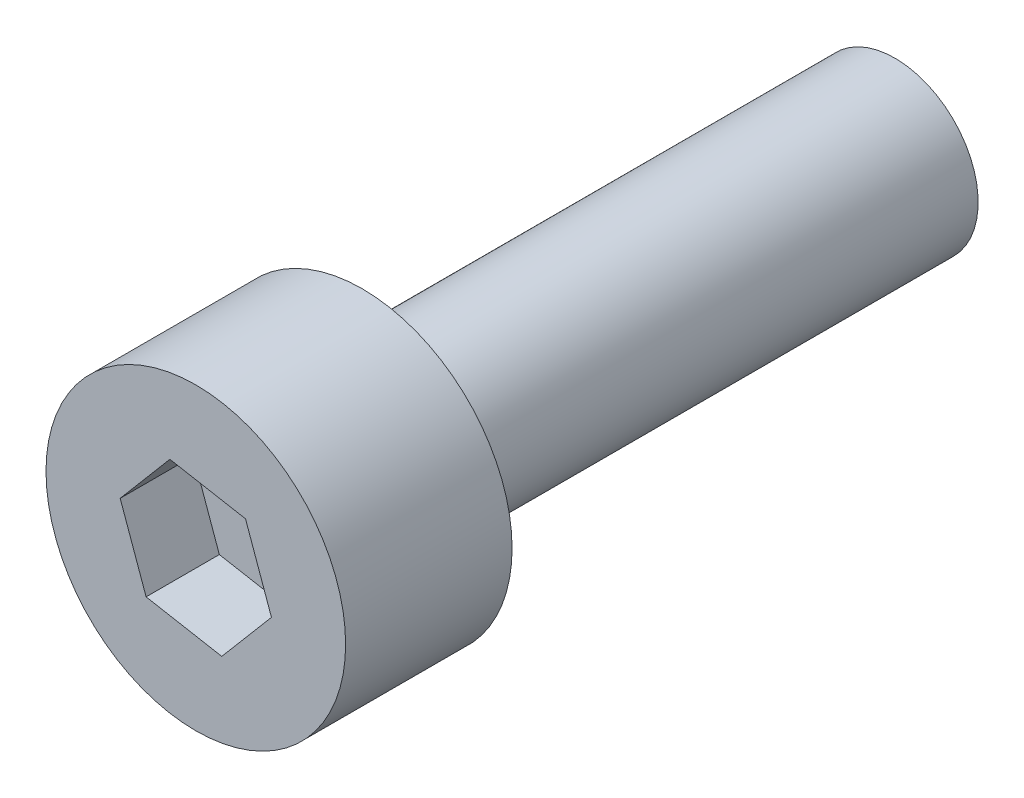
ISO-10303-21;
HEADER;
FILE_DESCRIPTION(('STEP AP214'),'2;1');
FILE_NAME('part.step','',(''),(''),'','','');
FILE_SCHEMA(('AUTOMOTIVE_DESIGN { 1 0 10303 214 1 1 1 1 }'));
ENDSEC;
DATA;
#1=APPLICATION_CONTEXT('core data for automotive mechanical design processes');
#2=APPLICATION_PROTOCOL_DEFINITION('international standard','automotive_design',2000,#1);
#3=PRODUCT_CONTEXT('',#1,'mechanical');
#4=PRODUCT('Part','Part','',(#3));
#5=PRODUCT_RELATED_PRODUCT_CATEGORY('part','',(#4));
#6=PRODUCT_DEFINITION_FORMATION('','',#4);
#7=PRODUCT_DEFINITION_CONTEXT('part definition',#1,'design');
#8=PRODUCT_DEFINITION('design','',#6,#7);
#9=PRODUCT_DEFINITION_SHAPE('','',#8);
#10=(LENGTH_UNIT() NAMED_UNIT(*) SI_UNIT(.MILLI.,.METRE.));
#11=(NAMED_UNIT(*) PLANE_ANGLE_UNIT() SI_UNIT($,.RADIAN.));
#12=(NAMED_UNIT(*) SI_UNIT($,.STERADIAN.) SOLID_ANGLE_UNIT());
#13=UNCERTAINTY_MEASURE_WITH_UNIT(LENGTH_MEASURE(1.E-05),#10,'distance_accuracy_value','');
#14=(GEOMETRIC_REPRESENTATION_CONTEXT(3) GLOBAL_UNCERTAINTY_ASSIGNED_CONTEXT((#13)) GLOBAL_UNIT_ASSIGNED_CONTEXT((#10,
#11,#12)) REPRESENTATION_CONTEXT('',''));
#15=CARTESIAN_POINT('',(0.,0.,0.));
#16=DIRECTION('',(0.,0.,1.));
#17=DIRECTION('',(1.,0.,0.));
#18=AXIS2_PLACEMENT_3D('',#15,#16,#17);
#19=CARTESIAN_POINT('',(0.,0.,2.5));
#20=DIRECTION('',(0.,0.,-1.));
#21=DIRECTION('',(-1.,0.,0.));
#22=AXIS2_PLACEMENT_3D('',#19,#20,#21);
#23=CYLINDRICAL_SURFACE('',#22,2.25);
#24=CARTESIAN_POINT('',(0.,0.,2.5));
#25=DIRECTION('',(0.,0.,1.));
#26=DIRECTION('',(1.,0.,0.));
#27=AXIS2_PLACEMENT_3D('',#24,#25,#26);
#28=CIRCLE('',#27,2.25);
#29=CARTESIAN_POINT('',(2.25,0.,2.5));
#30=VERTEX_POINT('',#29);
#31=EDGE_CURVE('E45',#30,#30,#28,.T.);
#32=ORIENTED_EDGE('',*,*,#31,.F.);
#33=EDGE_LOOP('',(#32));
#34=FACE_BOUND('',#33,.T.);
#35=CARTESIAN_POINT('',(0.,0.,0.));
#36=DIRECTION('',(0.,0.,1.));
#37=DIRECTION('',(1.,0.,0.));
#38=AXIS2_PLACEMENT_3D('',#35,#36,#37);
#39=CIRCLE('',#38,2.25);
#40=CARTESIAN_POINT('',(2.25,0.,0.));
#41=VERTEX_POINT('',#40);
#42=EDGE_CURVE('E40',#41,#41,#39,.T.);
#43=ORIENTED_EDGE('',*,*,#42,.T.);
#44=EDGE_LOOP('',(#43));
#45=FACE_BOUND('',#44,.T.);
#46=ADVANCED_FACE('F37',(#34,#45),#23,.T.);
#47=CARTESIAN_POINT('',(0.,0.,2.5));
#48=DIRECTION('',(0.,0.,1.));
#49=DIRECTION('',(1.,0.,0.));
#50=AXIS2_PLACEMENT_3D('',#47,#48,#49);
#51=PLANE('',#50);
#52=DIRECTION('',(0.983936268345051,-0.178520082442331,0.));
#53=VECTOR('',#52,1.);
#54=CARTESIAN_POINT('',(-0.178520082442331,-0.983936268345051,2.5));
#55=LINE('',#54,#53);
#56=CARTESIAN_POINT('',(-0.746595951836782,-0.880867650691217,2.5));
#57=VERTEX_POINT('',#56);
#58=CARTESIAN_POINT('',(0.389555786952119,-1.08700488599889,2.5));
#59=VERTEX_POINT('',#58);
#60=EDGE_CURVE('E53',#57,#59,#55,.T.);
#61=ORIENTED_EDGE('',*,*,#60,.F.);
#62=DIRECTION('',(0.337365207691775,-0.941373845312842,0.));
#63=VECTOR('',#62,1.);
#64=CARTESIAN_POINT('',(-0.941373845312842,-0.337365207691775,2.5));
#65=LINE('',#64,#63);
#66=CARTESIAN_POINT('',(-1.1361517387889,0.206137235307668,2.5));
#67=VERTEX_POINT('',#66);
#68=EDGE_CURVE('E137',#67,#57,#65,.T.);
#69=ORIENTED_EDGE('',*,*,#68,.F.);
#70=DIRECTION('',(-0.646571060653276,-0.762853762870511,0.));
#71=VECTOR('',#70,1.);
#72=CARTESIAN_POINT('',(-0.762853762870511,0.646571060653276,2.5));
#73=LINE('',#72,#71);
#74=CARTESIAN_POINT('',(-0.38955578695212,1.08700488599888,2.5));
#75=VERTEX_POINT('',#74);
#76=EDGE_CURVE('E135',#75,#67,#73,.T.);
#77=ORIENTED_EDGE('',*,*,#76,.F.);
#78=DIRECTION('',(-0.983936268345051,0.178520082442331,0.));
#79=VECTOR('',#78,1.);
#80=CARTESIAN_POINT('',(0.178520082442331,0.983936268345051,2.5));
#81=LINE('',#80,#79);
#82=CARTESIAN_POINT('',(0.746595951836781,0.880867650691217,2.5));
#83=VERTEX_POINT('',#82);
#84=EDGE_CURVE('E101',#83,#75,#81,.T.);
#85=ORIENTED_EDGE('',*,*,#84,.F.);
#86=DIRECTION('',(-0.337365207691774,0.941373845312842,0.));
#87=VECTOR('',#86,1.);
#88=CARTESIAN_POINT('',(0.941373845312841,0.337365207691774,2.5));
#89=LINE('',#88,#87);
#90=CARTESIAN_POINT('',(1.1361517387889,-0.206137235307668,2.5));
#91=VERTEX_POINT('',#90);
#92=EDGE_CURVE('E131',#91,#83,#89,.T.);
#93=ORIENTED_EDGE('',*,*,#92,.F.);
#94=DIRECTION('',(0.646571060653276,0.762853762870511,0.));
#95=VECTOR('',#94,1.);
#96=CARTESIAN_POINT('',(0.762853762870511,-0.646571060653276,2.5));
#97=LINE('',#96,#95);
#98=EDGE_CURVE('E127',#59,#91,#97,.T.);
#99=ORIENTED_EDGE('',*,*,#98,.F.);
#100=EDGE_LOOP('',(#61,#69,#77,#85,#93,#99));
#101=FACE_BOUND('',#100,.T.);
#102=ORIENTED_EDGE('',*,*,#31,.T.);
#103=EDGE_LOOP('',(#102));
#104=FACE_BOUND('',#103,.T.);
#105=ADVANCED_FACE('F155',(#101,#104),#51,.T.);
#106=CARTESIAN_POINT('',(0.,0.,0.));
#107=DIRECTION('',(0.,0.,1.));
#108=DIRECTION('',(1.,0.,0.));
#109=AXIS2_PLACEMENT_3D('',#106,#107,#108);
#110=PLANE('',#109);
#111=CARTESIAN_POINT('',(0.,0.,0.));
#112=DIRECTION('',(0.,0.,-1.));
#113=DIRECTION('',(-1.,0.,0.));
#114=AXIS2_PLACEMENT_3D('',#111,#112,#113);
#115=CIRCLE('',#114,1.25);
#116=CARTESIAN_POINT('',(-1.25,0.,0.));
#117=VERTEX_POINT('',#116);
#118=EDGE_CURVE('E11',#117,#117,#115,.T.);
#119=ORIENTED_EDGE('',*,*,#118,.F.);
#120=EDGE_LOOP('',(#119));
#121=FACE_BOUND('',#120,.T.);
#122=ORIENTED_EDGE('',*,*,#42,.F.);
#123=EDGE_LOOP('',(#122));
#124=FACE_BOUND('',#123,.T.);
#125=ADVANCED_FACE('F152',(#121,#124),#110,.F.);
#126=CARTESIAN_POINT('',(-0.178520082442331,-0.983936268345051,1.4));
#127=DIRECTION('',(-0.178520082442331,-0.98393626834505,0.));
#128=DIRECTION('',(0.983936268345051,-0.178520082442331,0.));
#129=AXIS2_PLACEMENT_3D('',#126,#127,#128);
#130=PLANE('',#129);
#131=ORIENTED_EDGE('',*,*,#60,.T.);
#132=DIRECTION('',(0.,0.,1.));
#133=VECTOR('',#132,1.);
#134=CARTESIAN_POINT('',(0.389555786952119,-1.08700488599889,1.4));
#135=LINE('',#134,#133);
#136=CARTESIAN_POINT('',(0.389555786952119,-1.08700488599889,1.4));
#137=VERTEX_POINT('',#136);
#138=EDGE_CURVE('E83',#137,#59,#135,.T.);
#139=ORIENTED_EDGE('',*,*,#138,.F.);
#140=DIRECTION('',(0.983936268345051,-0.178520082442331,0.));
#141=VECTOR('',#140,1.);
#142=CARTESIAN_POINT('',(-0.178520082442331,-0.983936268345051,1.4));
#143=LINE('',#142,#141);
#144=CARTESIAN_POINT('',(-0.746595951836782,-0.880867650691217,1.4));
#145=VERTEX_POINT('',#144);
#146=EDGE_CURVE('E139',#145,#137,#143,.T.);
#147=ORIENTED_EDGE('',*,*,#146,.F.);
#148=DIRECTION('',(0.,0.,1.));
#149=VECTOR('',#148,1.);
#150=CARTESIAN_POINT('',(-0.746595951836782,-0.880867650691217,1.4));
#151=LINE('',#150,#149);
#152=EDGE_CURVE('E61',#145,#57,#151,.T.);
#153=ORIENTED_EDGE('',*,*,#152,.T.);
#154=EDGE_LOOP('',(#131,#139,#147,#153));
#155=FACE_BOUND('',#154,.T.);
#156=ADVANCED_FACE('F154',(#155),#130,.F.);
#157=CARTESIAN_POINT('',(-0.941373845312842,-0.337365207691775,1.4));
#158=DIRECTION('',(-0.941373845312842,-0.337365207691775,0.));
#159=DIRECTION('',(0.337365207691775,-0.941373845312842,0.));
#160=AXIS2_PLACEMENT_3D('',#157,#158,#159);
#161=PLANE('',#160);
#162=ORIENTED_EDGE('',*,*,#68,.T.);
#163=ORIENTED_EDGE('',*,*,#152,.F.);
#164=DIRECTION('',(0.337365207691775,-0.941373845312842,0.));
#165=VECTOR('',#164,1.);
#166=CARTESIAN_POINT('',(-0.941373845312842,-0.337365207691775,1.4));
#167=LINE('',#166,#165);
#168=CARTESIAN_POINT('',(-1.1361517387889,0.206137235307668,1.4));
#169=VERTEX_POINT('',#168);
#170=EDGE_CURVE('E113',#169,#145,#167,.T.);
#171=ORIENTED_EDGE('',*,*,#170,.F.);
#172=DIRECTION('',(0.,0.,1.));
#173=VECTOR('',#172,1.);
#174=CARTESIAN_POINT('',(-1.1361517387889,0.206137235307668,1.4));
#175=LINE('',#174,#173);
#176=EDGE_CURVE('E105',#169,#67,#175,.T.);
#177=ORIENTED_EDGE('',*,*,#176,.T.);
#178=EDGE_LOOP('',(#162,#163,#171,#177));
#179=FACE_BOUND('',#178,.T.);
#180=ADVANCED_FACE('F161',(#179),#161,.F.);
#181=CARTESIAN_POINT('',(-0.762853762870511,0.646571060653276,1.4));
#182=DIRECTION('',(-0.762853762870511,0.646571060653276,0.));
#183=DIRECTION('',(-0.646571060653276,-0.762853762870511,0.));
#184=AXIS2_PLACEMENT_3D('',#181,#182,#183);
#185=PLANE('',#184);
#186=ORIENTED_EDGE('',*,*,#76,.T.);
#187=ORIENTED_EDGE('',*,*,#176,.F.);
#188=DIRECTION('',(-0.646571060653276,-0.762853762870511,0.));
#189=VECTOR('',#188,1.);
#190=CARTESIAN_POINT('',(-0.762853762870511,0.646571060653276,1.4));
#191=LINE('',#190,#189);
#192=CARTESIAN_POINT('',(-0.38955578695212,1.08700488599888,1.4));
#193=VERTEX_POINT('',#192);
#194=EDGE_CURVE('E109',#193,#169,#191,.T.);
#195=ORIENTED_EDGE('',*,*,#194,.F.);
#196=DIRECTION('',(0.,0.,1.));
#197=VECTOR('',#196,1.);
#198=CARTESIAN_POINT('',(-0.38955578695212,1.08700488599888,1.4));
#199=LINE('',#198,#197);
#200=EDGE_CURVE('E94',#193,#75,#199,.T.);
#201=ORIENTED_EDGE('',*,*,#200,.T.);
#202=EDGE_LOOP('',(#186,#187,#195,#201));
#203=FACE_BOUND('',#202,.T.);
#204=ADVANCED_FACE('F110',(#203),#185,.F.);
#205=CARTESIAN_POINT('',(0.178520082442331,0.983936268345051,1.4));
#206=DIRECTION('',(0.178520082442331,0.98393626834505,0.));
#207=DIRECTION('',(-0.983936268345051,0.178520082442331,0.));
#208=AXIS2_PLACEMENT_3D('',#205,#206,#207);
#209=PLANE('',#208);
#210=ORIENTED_EDGE('',*,*,#84,.T.);
#211=ORIENTED_EDGE('',*,*,#200,.F.);
#212=DIRECTION('',(-0.983936268345051,0.178520082442331,0.));
#213=VECTOR('',#212,1.);
#214=CARTESIAN_POINT('',(0.178520082442331,0.983936268345051,1.4));
#215=LINE('',#214,#213);
#216=CARTESIAN_POINT('',(0.746595951836781,0.880867650691217,1.4));
#217=VERTEX_POINT('',#216);
#218=EDGE_CURVE('E98',#217,#193,#215,.T.);
#219=ORIENTED_EDGE('',*,*,#218,.F.);
#220=DIRECTION('',(0.,0.,1.));
#221=VECTOR('',#220,1.);
#222=CARTESIAN_POINT('',(0.746595951836781,0.880867650691217,1.4));
#223=LINE('',#222,#221);
#224=EDGE_CURVE('E106',#217,#83,#223,.T.);
#225=ORIENTED_EDGE('',*,*,#224,.T.);
#226=EDGE_LOOP('',(#210,#211,#219,#225));
#227=FACE_BOUND('',#226,.T.);
#228=ADVANCED_FACE('F96',(#227),#209,.F.);
#229=CARTESIAN_POINT('',(0.941373845312841,0.337365207691774,1.4));
#230=DIRECTION('',(0.941373845312842,0.337365207691775,0.));
#231=DIRECTION('',(-0.337365207691775,0.941373845312842,0.));
#232=AXIS2_PLACEMENT_3D('',#229,#230,#231);
#233=PLANE('',#232);
#234=ORIENTED_EDGE('',*,*,#92,.T.);
#235=ORIENTED_EDGE('',*,*,#224,.F.);
#236=DIRECTION('',(-0.337365207691774,0.941373845312842,0.));
#237=VECTOR('',#236,1.);
#238=CARTESIAN_POINT('',(0.941373845312841,0.337365207691774,1.4));
#239=LINE('',#238,#237);
#240=CARTESIAN_POINT('',(1.1361517387889,-0.206137235307668,1.4));
#241=VERTEX_POINT('',#240);
#242=EDGE_CURVE('E119',#241,#217,#239,.T.);
#243=ORIENTED_EDGE('',*,*,#242,.F.);
#244=DIRECTION('',(0.,0.,1.));
#245=VECTOR('',#244,1.);
#246=CARTESIAN_POINT('',(1.1361517387889,-0.206137235307668,1.4));
#247=LINE('',#246,#245);
#248=EDGE_CURVE('E143',#241,#91,#247,.T.);
#249=ORIENTED_EDGE('',*,*,#248,.T.);
#250=EDGE_LOOP('',(#234,#235,#243,#249));
#251=FACE_BOUND('',#250,.T.);
#252=ADVANCED_FACE('F206',(#251),#233,.F.);
#253=CARTESIAN_POINT('',(0.762853762870511,-0.646571060653276,1.4));
#254=DIRECTION('',(0.762853762870511,-0.646571060653276,0.));
#255=DIRECTION('',(0.646571060653276,0.762853762870511,0.));
#256=AXIS2_PLACEMENT_3D('',#253,#254,#255);
#257=PLANE('',#256);
#258=ORIENTED_EDGE('',*,*,#98,.T.);
#259=ORIENTED_EDGE('',*,*,#248,.F.);
#260=DIRECTION('',(0.646571060653276,0.762853762870511,0.));
#261=VECTOR('',#260,1.);
#262=CARTESIAN_POINT('',(0.762853762870511,-0.646571060653276,1.4));
#263=LINE('',#262,#261);
#264=EDGE_CURVE('E121',#137,#241,#263,.T.);
#265=ORIENTED_EDGE('',*,*,#264,.F.);
#266=ORIENTED_EDGE('',*,*,#138,.T.);
#267=EDGE_LOOP('',(#258,#259,#265,#266));
#268=FACE_BOUND('',#267,.T.);
#269=ADVANCED_FACE('F215',(#268),#257,.F.);
#270=CARTESIAN_POINT('',(0.,0.,1.4));
#271=DIRECTION('',(0.,0.,1.));
#272=DIRECTION('',(1.,0.,0.));
#273=AXIS2_PLACEMENT_3D('',#270,#271,#272);
#274=PLANE('',#273);
#275=ORIENTED_EDGE('',*,*,#146,.T.);
#276=ORIENTED_EDGE('',*,*,#264,.T.);
#277=ORIENTED_EDGE('',*,*,#242,.T.);
#278=ORIENTED_EDGE('',*,*,#218,.T.);
#279=ORIENTED_EDGE('',*,*,#194,.T.);
#280=ORIENTED_EDGE('',*,*,#170,.T.);
#281=EDGE_LOOP('',(#275,#276,#277,#278,#279,#280));
#282=FACE_BOUND('',#281,.T.);
#283=ADVANCED_FACE('F116',(#282),#274,.T.);
#284=CARTESIAN_POINT('',(0.,0.,-8.));
#285=DIRECTION('',(0.,0.,1.));
#286=DIRECTION('',(1.,0.,0.));
#287=AXIS2_PLACEMENT_3D('',#284,#285,#286);
#288=CYLINDRICAL_SURFACE('',#287,1.25);
#289=CARTESIAN_POINT('',(0.,0.,-8.));
#290=DIRECTION('',(0.,0.,-1.));
#291=DIRECTION('',(-1.,0.,0.));
#292=AXIS2_PLACEMENT_3D('',#289,#290,#291);
#293=CIRCLE('',#292,1.25);
#294=CARTESIAN_POINT('',(-1.25,0.,-8.));
#295=VERTEX_POINT('',#294);
#296=EDGE_CURVE('E128',#295,#295,#293,.T.);
#297=ORIENTED_EDGE('',*,*,#296,.F.);
#298=EDGE_LOOP('',(#297));
#299=FACE_BOUND('',#298,.T.);
#300=ORIENTED_EDGE('',*,*,#118,.T.);
#301=EDGE_LOOP('',(#300));
#302=FACE_BOUND('',#301,.T.);
#303=ADVANCED_FACE('F233',(#299,#302),#288,.T.);
#304=CARTESIAN_POINT('',(0.,0.,-8.));
#305=DIRECTION('',(0.,0.,-1.));
#306=DIRECTION('',(-1.,0.,0.));
#307=AXIS2_PLACEMENT_3D('',#304,#305,#306);
#308=PLANE('',#307);
#309=ORIENTED_EDGE('',*,*,#296,.T.);
#310=EDGE_LOOP('',(#309));
#311=FACE_BOUND('',#310,.T.);
#312=ADVANCED_FACE('F246',(#311),#308,.T.);
#313=CLOSED_SHELL('',(#46,#105,#125,#156,#180,#204,#228,#252,#269,#283,#303,#312));
#314=MANIFOLD_SOLID_BREP('B2',#313);
#315=ADVANCED_BREP_SHAPE_REPRESENTATION('',(#18,#314),#14);
#316=SHAPE_DEFINITION_REPRESENTATION(#9,#315);
ENDSEC;
END-ISO-10303-21;
